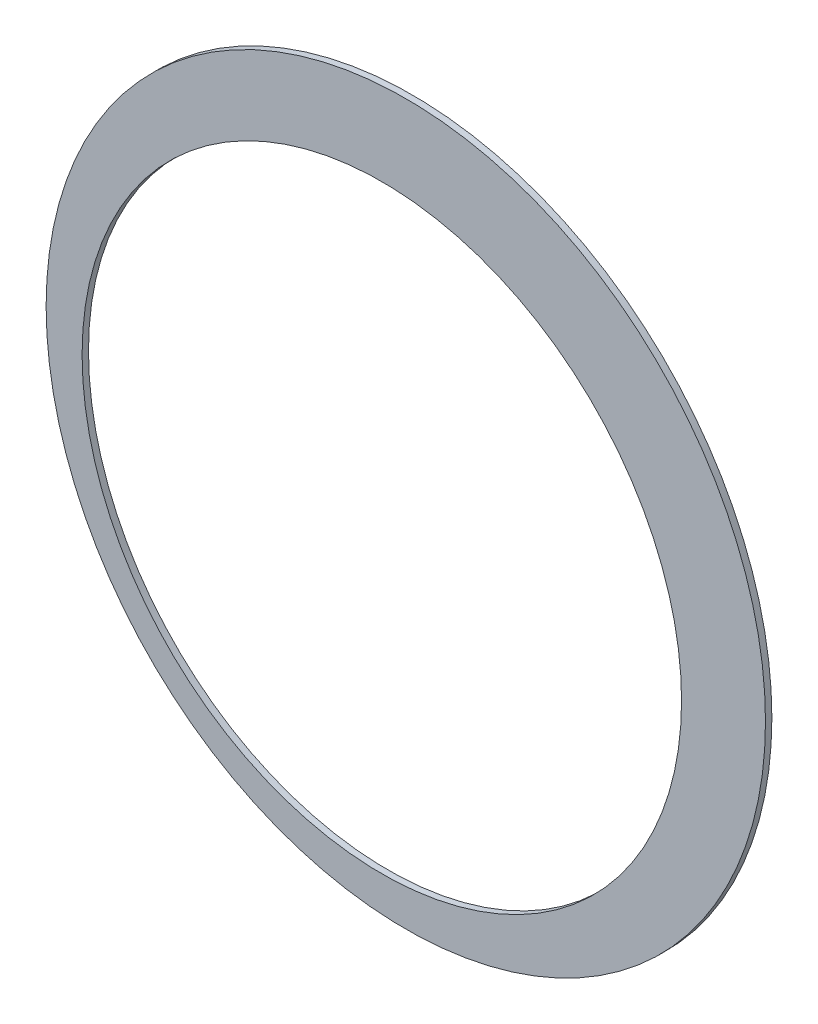
ISO-10303-21;
HEADER;
FILE_DESCRIPTION(('STEP AP214'),'2;1');
FILE_NAME('part.step','',(''),(''),'','','');
FILE_SCHEMA(('AUTOMOTIVE_DESIGN { 1 0 10303 214 1 1 1 1 }'));
ENDSEC;
DATA;
#1=APPLICATION_CONTEXT('core data for automotive mechanical design processes');
#2=APPLICATION_PROTOCOL_DEFINITION('international standard','automotive_design',2000,#1);
#3=PRODUCT_CONTEXT('',#1,'mechanical');
#4=PRODUCT('Part','Part','',(#3));
#5=PRODUCT_RELATED_PRODUCT_CATEGORY('part','',(#4));
#6=PRODUCT_DEFINITION_FORMATION('','',#4);
#7=PRODUCT_DEFINITION_CONTEXT('part definition',#1,'design');
#8=PRODUCT_DEFINITION('design','',#6,#7);
#9=PRODUCT_DEFINITION_SHAPE('','',#8);
#10=(LENGTH_UNIT() NAMED_UNIT(*) SI_UNIT(.MILLI.,.METRE.));
#11=(NAMED_UNIT(*) PLANE_ANGLE_UNIT() SI_UNIT($,.RADIAN.));
#12=(NAMED_UNIT(*) SI_UNIT($,.STERADIAN.) SOLID_ANGLE_UNIT());
#13=UNCERTAINTY_MEASURE_WITH_UNIT(LENGTH_MEASURE(1.E-05),#10,'distance_accuracy_value','');
#14=(GEOMETRIC_REPRESENTATION_CONTEXT(3) GLOBAL_UNCERTAINTY_ASSIGNED_CONTEXT((#13)) GLOBAL_UNIT_ASSIGNED_CONTEXT((#10,
#11,#12)) REPRESENTATION_CONTEXT('',''));
#15=CARTESIAN_POINT('',(0.,0.,0.));
#16=DIRECTION('',(0.,0.,1.));
#17=DIRECTION('',(1.,0.,0.));
#18=AXIS2_PLACEMENT_3D('',#15,#16,#17);
#19=CARTESIAN_POINT('',(3.,3.,0.8));
#20=DIRECTION('',(0.,0.,1.));
#21=DIRECTION('',(1.,0.,0.));
#22=AXIS2_PLACEMENT_3D('',#19,#20,#21);
#23=PLANE('',#22);
#24=CARTESIAN_POINT('',(3.,3.,0.8));
#25=DIRECTION('',(0.,0.,1.));
#26=DIRECTION('',(1.,0.,0.));
#27=AXIS2_PLACEMENT_3D('',#24,#25,#26);
#28=CIRCLE('',#27,45.);
#29=CARTESIAN_POINT('',(48.,3.,0.8));
#30=VERTEX_POINT('',#29);
#31=EDGE_CURVE('E10',#30,#30,#28,.T.);
#32=ORIENTED_EDGE('',*,*,#31,.T.);
#33=EDGE_LOOP('',(#32));
#34=FACE_BOUND('',#33,.T.);
#35=CARTESIAN_POINT('',(0.,0.,0.8));
#36=DIRECTION('',(0.,0.,1.));
#37=DIRECTION('',(1.,0.,0.));
#38=AXIS2_PLACEMENT_3D('',#35,#36,#37);
#39=CIRCLE('',#38,37.5);
#40=CARTESIAN_POINT('',(37.5,0.,0.8));
#41=VERTEX_POINT('',#40);
#42=EDGE_CURVE('E31',#41,#41,#39,.T.);
#43=ORIENTED_EDGE('',*,*,#42,.F.);
#44=EDGE_LOOP('',(#43));
#45=FACE_BOUND('',#44,.T.);
#46=ADVANCED_FACE('F20',(#34,#45),#23,.T.);
#47=CARTESIAN_POINT('',(3.,3.,0.));
#48=DIRECTION('',(0.,0.,1.));
#49=DIRECTION('',(1.,0.,0.));
#50=AXIS2_PLACEMENT_3D('',#47,#48,#49);
#51=PLANE('',#50);
#52=CARTESIAN_POINT('',(3.,3.,0.));
#53=DIRECTION('',(0.,0.,1.));
#54=DIRECTION('',(1.,0.,0.));
#55=AXIS2_PLACEMENT_3D('',#52,#53,#54);
#56=CIRCLE('',#55,45.);
#57=CARTESIAN_POINT('',(48.,3.,0.));
#58=VERTEX_POINT('',#57);
#59=EDGE_CURVE('E27',#58,#58,#56,.T.);
#60=ORIENTED_EDGE('',*,*,#59,.F.);
#61=EDGE_LOOP('',(#60));
#62=FACE_BOUND('',#61,.T.);
#63=CARTESIAN_POINT('',(0.,0.,0.));
#64=DIRECTION('',(0.,0.,1.));
#65=DIRECTION('',(1.,0.,0.));
#66=AXIS2_PLACEMENT_3D('',#63,#64,#65);
#67=CIRCLE('',#66,37.5);
#68=CARTESIAN_POINT('',(37.5,0.,0.));
#69=VERTEX_POINT('',#68);
#70=EDGE_CURVE('E35',#69,#69,#67,.T.);
#71=ORIENTED_EDGE('',*,*,#70,.T.);
#72=EDGE_LOOP('',(#71));
#73=FACE_BOUND('',#72,.T.);
#74=ADVANCED_FACE('F41',(#62,#73),#51,.F.);
#75=CARTESIAN_POINT('',(3.,3.,0.8));
#76=DIRECTION('',(0.,0.,-1.));
#77=DIRECTION('',(-1.,0.,0.));
#78=AXIS2_PLACEMENT_3D('',#75,#76,#77);
#79=CYLINDRICAL_SURFACE('',#78,45.);
#80=ORIENTED_EDGE('',*,*,#31,.F.);
#81=EDGE_LOOP('',(#80));
#82=FACE_BOUND('',#81,.T.);
#83=ORIENTED_EDGE('',*,*,#59,.T.);
#84=EDGE_LOOP('',(#83));
#85=FACE_BOUND('',#84,.T.);
#86=ADVANCED_FACE('F22',(#82,#85),#79,.T.);
#87=CARTESIAN_POINT('',(0.,0.,0.8));
#88=DIRECTION('',(0.,0.,-1.));
#89=DIRECTION('',(-1.,0.,0.));
#90=AXIS2_PLACEMENT_3D('',#87,#88,#89);
#91=CYLINDRICAL_SURFACE('',#90,37.5);
#92=ORIENTED_EDGE('',*,*,#42,.T.);
#93=EDGE_LOOP('',(#92));
#94=FACE_BOUND('',#93,.T.);
#95=ORIENTED_EDGE('',*,*,#70,.F.);
#96=EDGE_LOOP('',(#95));
#97=FACE_BOUND('',#96,.T.);
#98=ADVANCED_FACE('F43',(#94,#97),#91,.F.);
#99=CLOSED_SHELL('',(#46,#74,#86,#98));
#100=MANIFOLD_SOLID_BREP('B2',#99);
#101=ADVANCED_BREP_SHAPE_REPRESENTATION('',(#18,#100),#14);
#102=SHAPE_DEFINITION_REPRESENTATION(#9,#101);
ENDSEC;
END-ISO-10303-21;
